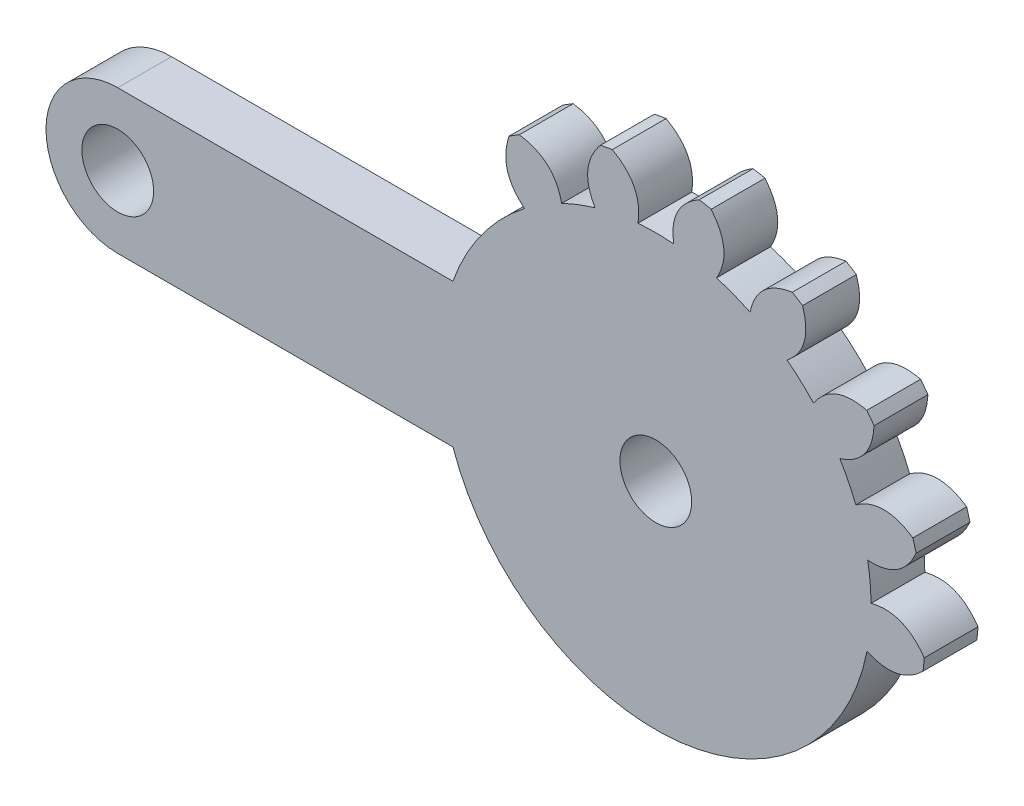
ISO-10303-21;
HEADER;
FILE_DESCRIPTION(('STEP AP214'),'2;1');
FILE_NAME('part.step','',(''),(''),'','','');
FILE_SCHEMA(('AUTOMOTIVE_DESIGN { 1 0 10303 214 1 1 1 1 }'));
ENDSEC;
DATA;
#1=APPLICATION_CONTEXT('core data for automotive mechanical design processes');
#2=APPLICATION_PROTOCOL_DEFINITION('international standard','automotive_design',2000,#1);
#3=PRODUCT_CONTEXT('',#1,'mechanical');
#4=PRODUCT('Part','Part','',(#3));
#5=PRODUCT_RELATED_PRODUCT_CATEGORY('part','',(#4));
#6=PRODUCT_DEFINITION_FORMATION('','',#4);
#7=PRODUCT_DEFINITION_CONTEXT('part definition',#1,'design');
#8=PRODUCT_DEFINITION('design','',#6,#7);
#9=PRODUCT_DEFINITION_SHAPE('','',#8);
#10=(LENGTH_UNIT() NAMED_UNIT(*) SI_UNIT(.MILLI.,.METRE.));
#11=(NAMED_UNIT(*) PLANE_ANGLE_UNIT() SI_UNIT($,.RADIAN.));
#12=(NAMED_UNIT(*) SI_UNIT($,.STERADIAN.) SOLID_ANGLE_UNIT());
#13=UNCERTAINTY_MEASURE_WITH_UNIT(LENGTH_MEASURE(1.E-05),#10,'distance_accuracy_value','');
#14=(GEOMETRIC_REPRESENTATION_CONTEXT(3) GLOBAL_UNCERTAINTY_ASSIGNED_CONTEXT((#13)) GLOBAL_UNIT_ASSIGNED_CONTEXT((#10,
#11,#12)) REPRESENTATION_CONTEXT('',''));
#15=CARTESIAN_POINT('',(0.,0.,0.));
#16=DIRECTION('',(0.,0.,1.));
#17=DIRECTION('',(1.,0.,0.));
#18=AXIS2_PLACEMENT_3D('',#15,#16,#17);
#19=CARTESIAN_POINT('',(0.,0.,3.));
#20=DIRECTION('',(0.,0.,-1.));
#21=DIRECTION('',(0.273662990072083,0.961825643172819,0.));
#22=AXIS2_PLACEMENT_3D('',#19,#20,#21);
#23=CYLINDRICAL_SURFACE('',#22,12.);
#24=DIRECTION('',(0.,0.,-1.));
#25=VECTOR('',#24,1.);
#26=CARTESIAN_POINT('',(-11.3137084989847,-4.0000000000001,3.));
#27=LINE('',#26,#25);
#28=CARTESIAN_POINT('',(-11.3137084989847,-4.0000000000001,0.));
#29=VERTEX_POINT('',#28);
#30=CARTESIAN_POINT('',(-11.3137084989847,-4.0000000000001,3.));
#31=VERTEX_POINT('',#30);
#32=EDGE_CURVE('E11',#29,#31,#27,.F.);
#33=ORIENTED_EDGE('',*,*,#32,.F.);
#34=CARTESIAN_POINT('',(0.,0.,0.));
#35=DIRECTION('',(0.,0.,-1.));
#36=DIRECTION('',(-0.273662990072083,-0.961825643172819,0.));
#37=AXIS2_PLACEMENT_3D('',#34,#35,#36);
#38=CIRCLE('',#37,12.);
#39=CARTESIAN_POINT('',(11.7754248205339,-2.31070774784592,0.));
#40=VERTEX_POINT('',#39);
#41=EDGE_CURVE('E462',#40,#29,#38,.T.);
#42=ORIENTED_EDGE('',*,*,#41,.F.);
#43=DIRECTION('',(0.,0.,-1.));
#44=VECTOR('',#43,1.);
#45=CARTESIAN_POINT('',(11.7754248205339,-2.31070774784592,3.));
#46=LINE('',#45,#44);
#47=CARTESIAN_POINT('',(11.7754248205339,-2.31070774784592,3.));
#48=VERTEX_POINT('',#47);
#49=EDGE_CURVE('E467',#48,#40,#46,.T.);
#50=ORIENTED_EDGE('',*,*,#49,.F.);
#51=CARTESIAN_POINT('',(0.,0.,3.));
#52=DIRECTION('',(0.,0.,-1.));
#53=DIRECTION('',(-0.273662990072083,-0.961825643172819,0.));
#54=AXIS2_PLACEMENT_3D('',#51,#52,#53);
#55=CIRCLE('',#54,12.);
#56=EDGE_CURVE('E471',#48,#31,#55,.T.);
#57=ORIENTED_EDGE('',*,*,#56,.T.);
#58=EDGE_LOOP('',(#33,#42,#50,#57));
#59=FACE_BOUND('',#58,.T.);
#60=ADVANCED_FACE('F36',(#59),#23,.T.);
#61=CARTESIAN_POINT('',(0.,0.,3.));
#62=DIRECTION('',(0.,0.,1.));
#63=DIRECTION('',(1.,0.,0.));
#64=AXIS2_PLACEMENT_3D('',#61,#62,#63);
#65=PLANE('',#64);
#66=CARTESIAN_POINT('',(0.,0.,3.));
#67=DIRECTION('',(0.,0.,-1.));
#68=DIRECTION('',(-1.,0.,0.));
#69=AXIS2_PLACEMENT_3D('',#66,#67,#68);
#70=CIRCLE('',#69,2.);
#71=CARTESIAN_POINT('',(-2.,0.,3.));
#72=VERTEX_POINT('',#71);
#73=EDGE_CURVE('E271',#72,#72,#70,.T.);
#74=ORIENTED_EDGE('',*,*,#73,.T.);
#75=EDGE_LOOP('',(#74));
#76=FACE_BOUND('',#75,.T.);
#77=CARTESIAN_POINT('',(-30.,-1.04950770296597E-13,3.));
#78=DIRECTION('',(0.,0.,-1.));
#79=DIRECTION('',(-1.,0.,0.));
#80=AXIS2_PLACEMENT_3D('',#77,#78,#79);
#81=CIRCLE('',#80,2.);
#82=CARTESIAN_POINT('',(-32.,-1.04950770296597E-13,3.));
#83=VERTEX_POINT('',#82);
#84=EDGE_CURVE('E732',#83,#83,#81,.T.);
#85=ORIENTED_EDGE('',*,*,#84,.T.);
#86=EDGE_LOOP('',(#85));
#87=FACE_BOUND('',#86,.T.);
#88=DIRECTION('',(1.,0.,0.));
#89=VECTOR('',#88,1.);
#90=CARTESIAN_POINT('',(-30.,-4.0000000000001,3.));
#91=LINE('',#90,#89);
#92=CARTESIAN_POINT('',(-30.,-4.0000000000001,3.));
#93=VERTEX_POINT('',#92);
#94=EDGE_CURVE('E253',#93,#31,#91,.T.);
#95=ORIENTED_EDGE('',*,*,#94,.T.);
#96=ORIENTED_EDGE('',*,*,#56,.F.);
#97=CARTESIAN_POINT('',(14.9009709527392,-1.72077443775263,3.));
#98=CARTESIAN_POINT('',(13.4869977113862,-3.11181198953527,3.));
#99=CARTESIAN_POINT('',(11.7754248205339,-2.31070774784592,3.));
#100=B_SPLINE_CURVE_WITH_KNOTS('',2,(#97,#98,#99),.UNSPECIFIED.,.F.,.F.,(3,3),(0.,1.),.UNSPECIFIED.);
#101=CARTESIAN_POINT('',(14.9009709527392,-1.72077443775263,3.));
#102=VERTEX_POINT('',#101);
#103=EDGE_CURVE('E453',#102,#48,#100,.T.);
#104=ORIENTED_EDGE('',*,*,#103,.F.);
#105=CARTESIAN_POINT('',(0.,0.,3.));
#106=DIRECTION('',(0.,0.,1.));
#107=DIRECTION('',(1.,0.,0.));
#108=AXIS2_PLACEMENT_3D('',#105,#106,#107);
#109=CIRCLE('',#108,15.);
#110=CARTESIAN_POINT('',(14.9634450789219,-1.04657124463003,3.));
#111=VERTEX_POINT('',#110);
#112=EDGE_CURVE('E601',#102,#111,#109,.T.);
#113=ORIENTED_EDGE('',*,*,#112,.T.);
#114=CARTESIAN_POINT('',(11.9995172704166,0.107634924505339,3.));
#115=CARTESIAN_POINT('',(13.8291498984039,0.580598150726615,3.));
#116=CARTESIAN_POINT('',(14.963445078922,-1.04657124463002,3.));
#117=B_SPLINE_CURVE_WITH_KNOTS('',2,(#114,#115,#116),.UNSPECIFIED.,.F.,.F.,(3,3),(0.,1.),.UNSPECIFIED.);
#118=CARTESIAN_POINT('',(11.9995172704166,0.107634924505339,3.));
#119=VERTEX_POINT('',#118);
#120=EDGE_CURVE('E414',#119,#111,#117,.T.);
#121=ORIENTED_EDGE('',*,*,#120,.F.);
#122=CARTESIAN_POINT('',(0.,0.,3.));
#123=DIRECTION('',(0.,0.,-1.));
#124=DIRECTION('',(0.092268359463302,-0.995734176295035,0.));
#125=AXIS2_PLACEMENT_3D('',#122,#123,#124);
#126=CIRCLE('',#125,12.);
#127=CARTESIAN_POINT('',(11.81498055149,2.09910327709541,3.));
#128=VERTEX_POINT('',#127);
#129=EDGE_CURVE('E641',#128,#119,#126,.T.);
#130=ORIENTED_EDGE('',*,*,#129,.F.);
#131=CARTESIAN_POINT('',(14.5163570296163,3.77827719850066,3.));
#132=CARTESIAN_POINT('',(13.7003669718686,1.9703872617543,3.));
#133=CARTESIAN_POINT('',(11.81498055149,2.09910327709541,3.));
#134=B_SPLINE_CURVE_WITH_KNOTS('',2,(#131,#132,#133),.UNSPECIFIED.,.F.,.F.,(3,3),(0.,1.),.UNSPECIFIED.);
#135=CARTESIAN_POINT('',(14.5163570296163,3.77827719850066,3.));
#136=VERTEX_POINT('',#135);
#137=EDGE_CURVE('E423',#136,#128,#134,.T.);
#138=ORIENTED_EDGE('',*,*,#137,.F.);
#139=CARTESIAN_POINT('',(14.3310621325057,4.42952121049907,3.));
#140=VERTEX_POINT('',#139);
#141=EDGE_CURVE('E612',#136,#140,#109,.T.);
#142=ORIENTED_EDGE('',*,*,#141,.T.);
#143=CARTESIAN_POINT('',(11.1503344014532,4.43509219022208,3.));
#144=CARTESIAN_POINT('',(12.685561993178,5.5370568032474,3.));
#145=CARTESIAN_POINT('',(14.3310621325057,4.42952121049907,3.));
#146=B_SPLINE_CURVE_WITH_KNOTS('',2,(#143,#144,#145),.UNSPECIFIED.,.F.,.F.,(3,3),(0.,1.),.UNSPECIFIED.);
#147=CARTESIAN_POINT('',(11.1503344014532,4.43509219022208,3.));
#148=VERTEX_POINT('',#147);
#149=EDGE_CURVE('E339',#148,#140,#146,.T.);
#150=ORIENTED_EDGE('',*,*,#149,.F.);
#151=CARTESIAN_POINT('',(0.,0.,3.));
#152=DIRECTION('',(0.,0.,-1.));
#153=DIRECTION('',(0.445738355776538,-0.895163291355062,0.));
#154=AXIS2_PLACEMENT_3D('',#151,#152,#153);
#155=CIRCLE('',#154,12.);
#156=CARTESIAN_POINT('',(10.2588576899001,6.2254187729322,3.));
#157=VERTEX_POINT('',#156);
#158=EDGE_CURVE('E1062',#157,#148,#155,.T.);
#159=ORIENTED_EDGE('',*,*,#158,.F.);
#160=CARTESIAN_POINT('',(12.1712286517326,8.76705156293972,3.));
#161=CARTESIAN_POINT('',(12.063425756446,6.78647479505122,3.));
#162=CARTESIAN_POINT('',(10.2588576899001,6.2254187729322,3.));
#163=B_SPLINE_CURVE_WITH_KNOTS('',2,(#160,#161,#162),.UNSPECIFIED.,.F.,.F.,(3,3),(0.,1.),.UNSPECIFIED.);
#164=CARTESIAN_POINT('',(12.1712286517326,8.76705156293973,3.));
#165=VERTEX_POINT('',#164);
#166=EDGE_CURVE('E346',#165,#157,#163,.T.);
#167=ORIENTED_EDGE('',*,*,#166,.F.);
#168=CARTESIAN_POINT('',(11.7631898339379,9.30738228132592,3.));
#169=VERTEX_POINT('',#168);
#170=EDGE_CURVE('E607',#165,#169,#109,.T.);
#171=ORIENTED_EDGE('',*,*,#170,.T.);
#172=CARTESIAN_POINT('',(8.79523708543771,8.16356567995512,3.));
#173=CARTESIAN_POINT('',(9.82871864764787,9.74570525259871,3.));
#174=CARTESIAN_POINT('',(11.7631898339379,9.30738228132592,3.));
#175=B_SPLINE_CURVE_WITH_KNOTS('',2,(#172,#173,#174),.UNSPECIFIED.,.F.,.F.,(3,3),(0.,1.),.UNSPECIFIED.);
#176=CARTESIAN_POINT('',(8.79523708543771,8.16356567995512,3.));
#177=VERTEX_POINT('',#176);
#178=EDGE_CURVE('E377',#177,#169,#175,.T.);
#179=ORIENTED_EDGE('',*,*,#178,.F.);
#180=CARTESIAN_POINT('',(0.,0.,3.));
#181=DIRECTION('',(0.,0.,-1.));
#182=DIRECTION('',(0.739008917220659,-0.673695643646557,0.));
#183=AXIS2_PLACEMENT_3D('',#180,#181,#182);
#184=CIRCLE('',#183,12.);
#185=CARTESIAN_POINT('',(7.3172192509964,9.51095696724824,3.));
#186=VERTEX_POINT('',#185);
#187=EDGE_CURVE('E677',#186,#177,#184,.T.);
#188=ORIENTED_EDGE('',*,*,#187,.F.);
#189=CARTESIAN_POINT('',(8.18230840132622,12.571787033894,3.));
#190=CARTESIAN_POINT('',(8.79725204686573,10.6860113021215,3.));
#191=CARTESIAN_POINT('',(7.31721925099639,9.51095696724824,3.));
#192=B_SPLINE_CURVE_WITH_KNOTS('',2,(#189,#190,#191),.UNSPECIFIED.,.F.,.F.,(3,3),(0.,1.),.UNSPECIFIED.);
#193=CARTESIAN_POINT('',(8.18230840132622,12.571787033894,3.));
#194=VERTEX_POINT('',#193);
#195=EDGE_CURVE('E386',#194,#186,#192,.T.);
#196=ORIENTED_EDGE('',*,*,#195,.F.);
#197=CARTESIAN_POINT('',(7.60663356621178,12.9282298010741,3.));
#198=VERTEX_POINT('',#197);
#199=EDGE_CURVE('E602',#194,#198,#109,.T.);
#200=ORIENTED_EDGE('',*,*,#199,.T.);
#201=CARTESIAN_POINT('',(5.25229426494273,10.7895043887312,3.));
#202=CARTESIAN_POINT('',(5.64445238594272,12.6381422047695,3.));
#203=CARTESIAN_POINT('',(7.60663356621178,12.9282298010741,3.));
#204=B_SPLINE_CURVE_WITH_KNOTS('',2,(#201,#202,#203),.UNSPECIFIED.,.F.,.F.,(3,3),(0.,1.),.UNSPECIFIED.);
#205=CARTESIAN_POINT('',(5.25229426494273,10.7895043887312,3.));
#206=VERTEX_POINT('',#205);
#207=EDGE_CURVE('E482',#206,#198,#204,.T.);
#208=ORIENTED_EDGE('',*,*,#207,.F.);
#209=CARTESIAN_POINT('',(0.,0.,3.));
#210=DIRECTION('',(0.,0.,-1.));
#211=DIRECTION('',(0.932472229404356,-0.361241666187153,0.));
#212=AXIS2_PLACEMENT_3D('',#209,#210,#211);
#213=CIRCLE('',#212,12.);
#214=CARTESIAN_POINT('',(3.38734980613402,11.5119877211055,3.));
#215=VERTEX_POINT('',#214);
#216=EDGE_CURVE('E703',#215,#206,#213,.T.);
#217=ORIENTED_EDGE('',*,*,#216,.F.);
#218=CARTESIAN_POINT('',(3.08832206158472,14.6786330032442,3.));
#219=CARTESIAN_POINT('',(4.34296070109982,13.1423427696075,3.));
#220=CARTESIAN_POINT('',(3.38734980613401,11.5119877211055,3.));
#221=B_SPLINE_CURVE_WITH_KNOTS('',2,(#218,#219,#220),.UNSPECIFIED.,.F.,.F.,(3,3),(0.,1.),.UNSPECIFIED.);
#222=CARTESIAN_POINT('',(3.08832206158472,14.6786330032442,3.));
#223=VERTEX_POINT('',#222);
#224=EDGE_CURVE('E489',#223,#215,#221,.T.);
#225=ORIENTED_EDGE('',*,*,#224,.F.);
#226=CARTESIAN_POINT('',(2.42275928555709,14.8030482483929,3.));
#227=VERTEX_POINT('',#226);
#228=EDGE_CURVE('E498',#223,#227,#109,.T.);
#229=ORIENTED_EDGE('',*,*,#228,.T.);
#230=CARTESIAN_POINT('',(1.,11.9582607431014,3.));
#231=CARTESIAN_POINT('',(0.697871552525628,13.8237280218227,3.));
#232=CARTESIAN_POINT('',(2.42275928555709,14.8030482483929,3.));
#233=B_SPLINE_CURVE_WITH_KNOTS('',2,(#230,#231,#232),.UNSPECIFIED.,.F.,.F.,(3,3),(0.,1.),.UNSPECIFIED.);
#234=CARTESIAN_POINT('',(1.,11.9582607431014,3.));
#235=VERTEX_POINT('',#234);
#236=EDGE_CURVE('E525',#235,#227,#233,.T.);
#237=ORIENTED_EDGE('',*,*,#236,.F.);
#238=CARTESIAN_POINT('',(0.,0.,3.));
#239=DIRECTION('',(0.,0.,-1.));
#240=DIRECTION('',(1.,0.,0.));
#241=AXIS2_PLACEMENT_3D('',#238,#239,#240);
#242=CIRCLE('',#241,12.);
#243=CARTESIAN_POINT('',(-0.999999999999999,11.9582607431014,3.));
#244=VERTEX_POINT('',#243);
#245=EDGE_CURVE('E533',#244,#235,#242,.T.);
#246=ORIENTED_EDGE('',*,*,#245,.F.);
#247=CARTESIAN_POINT('',(-2.42275928555709,14.8030482483929,3.));
#248=CARTESIAN_POINT('',(-0.697871552525628,13.8237280218227,3.));
#249=CARTESIAN_POINT('',(-1.,11.9582607431014,3.));
#250=B_SPLINE_CURVE_WITH_KNOTS('',2,(#247,#248,#249),.UNSPECIFIED.,.F.,.F.,(3,3),(0.,1.),.UNSPECIFIED.);
#251=CARTESIAN_POINT('',(-2.42275928555709,14.8030482483929,3.));
#252=VERTEX_POINT('',#251);
#253=EDGE_CURVE('E555',#252,#244,#250,.T.);
#254=ORIENTED_EDGE('',*,*,#253,.F.);
#255=CARTESIAN_POINT('',(-3.08832206158473,14.6786330032442,3.));
#256=VERTEX_POINT('',#255);
#257=EDGE_CURVE('E589',#252,#256,#109,.T.);
#258=ORIENTED_EDGE('',*,*,#257,.T.);
#259=CARTESIAN_POINT('',(-3.38734980613402,11.5119877211055,3.));
#260=CARTESIAN_POINT('',(-4.34296070109982,13.1423427696075,3.));
#261=CARTESIAN_POINT('',(-3.08832206158472,14.6786330032442,3.));
#262=B_SPLINE_CURVE_WITH_KNOTS('',2,(#259,#260,#261),.UNSPECIFIED.,.F.,.F.,(3,3),(0.,1.),.UNSPECIFIED.);
#263=CARTESIAN_POINT('',(-3.38734980613402,11.5119877211055,3.));
#264=VERTEX_POINT('',#263);
#265=EDGE_CURVE('E277',#264,#256,#262,.T.);
#266=ORIENTED_EDGE('',*,*,#265,.F.);
#267=CARTESIAN_POINT('',(0.,0.,3.));
#268=DIRECTION('',(0.,0.,-1.));
#269=DIRECTION('',(0.932472229404356,0.361241666187153,0.));
#270=AXIS2_PLACEMENT_3D('',#267,#268,#269);
#271=CIRCLE('',#270,12.);
#272=CARTESIAN_POINT('',(-5.25229426494273,10.7895043887312,3.));
#273=VERTEX_POINT('',#272);
#274=EDGE_CURVE('E1087',#273,#264,#271,.T.);
#275=ORIENTED_EDGE('',*,*,#274,.F.);
#276=CARTESIAN_POINT('',(-7.60663356621178,12.9282298010741,3.));
#277=CARTESIAN_POINT('',(-5.64445238594272,12.6381422047695,3.));
#278=CARTESIAN_POINT('',(-5.25229426494273,10.7895043887312,3.));
#279=B_SPLINE_CURVE_WITH_KNOTS('',2,(#276,#277,#278),.UNSPECIFIED.,.F.,.F.,(3,3),(0.,1.),.UNSPECIFIED.);
#280=CARTESIAN_POINT('',(-7.60663356621178,12.9282298010741,3.));
#281=VERTEX_POINT('',#280);
#282=EDGE_CURVE('E284',#281,#273,#279,.T.);
#283=ORIENTED_EDGE('',*,*,#282,.F.);
#284=CARTESIAN_POINT('',(-8.18230840132622,12.571787033894,3.));
#285=VERTEX_POINT('',#284);
#286=EDGE_CURVE('E597',#281,#285,#109,.T.);
#287=ORIENTED_EDGE('',*,*,#286,.T.);
#288=CARTESIAN_POINT('',(-7.31721925099639,9.51095696724824,3.));
#289=CARTESIAN_POINT('',(-8.79725204686573,10.6860113021215,3.));
#290=CARTESIAN_POINT('',(-8.18230840132622,12.571787033894,3.));
#291=B_SPLINE_CURVE_WITH_KNOTS('',2,(#288,#289,#290),.UNSPECIFIED.,.F.,.F.,(3,3),(0.,1.),.UNSPECIFIED.);
#292=CARTESIAN_POINT('',(-7.31721925099639,9.51095696724824,3.));
#293=VERTEX_POINT('',#292);
#294=EDGE_CURVE('E317',#293,#285,#291,.T.);
#295=ORIENTED_EDGE('',*,*,#294,.F.);
#296=CARTESIAN_POINT('',(-11.3137084989848,3.9999999999999,3.));
#297=VERTEX_POINT('',#296);
#298=EDGE_CURVE('E470',#297,#293,#55,.T.);
#299=ORIENTED_EDGE('',*,*,#298,.F.);
#300=DIRECTION('',(-1.,0.,0.));
#301=VECTOR('',#300,1.);
#302=CARTESIAN_POINT('',(-30.,3.9999999999999,3.));
#303=LINE('',#302,#301);
#304=CARTESIAN_POINT('',(-30.,3.9999999999999,3.));
#305=VERTEX_POINT('',#304);
#306=EDGE_CURVE('E269',#297,#305,#303,.T.);
#307=ORIENTED_EDGE('',*,*,#306,.T.);
#308=CARTESIAN_POINT('',(-30.,-1.04950770296597E-13,3.));
#309=DIRECTION('',(0.,0.,1.));
#310=DIRECTION('',(1.,0.,0.));
#311=AXIS2_PLACEMENT_3D('',#308,#309,#310);
#312=CIRCLE('',#311,4.);
#313=EDGE_CURVE('E260',#305,#93,#312,.T.);
#314=ORIENTED_EDGE('',*,*,#313,.T.);
#315=EDGE_LOOP('',(#95,#96,#104,#113,#121,#130,#138,#142,#150,#159,#167,#171,#179,#188,#196,
#200,#208,#217,#225,#229,#237,#246,#254,#258,#266,#275,#283,#287,#295,#299,#307,#314));
#316=FACE_BOUND('',#315,.T.);
#317=ADVANCED_FACE('F624',(#76,#87,#316),#65,.T.);
#318=CARTESIAN_POINT('',(0.,0.,0.));
#319=DIRECTION('',(0.,0.,1.));
#320=DIRECTION('',(1.,0.,0.));
#321=AXIS2_PLACEMENT_3D('',#318,#319,#320);
#322=PLANE('',#321);
#323=CARTESIAN_POINT('',(0.,0.,0.));
#324=DIRECTION('',(0.,0.,-1.));
#325=DIRECTION('',(-1.,0.,0.));
#326=AXIS2_PLACEMENT_3D('',#323,#324,#325);
#327=CIRCLE('',#326,2.);
#328=CARTESIAN_POINT('',(-2.,0.,0.));
#329=VERTEX_POINT('',#328);
#330=EDGE_CURVE('E734',#329,#329,#327,.T.);
#331=ORIENTED_EDGE('',*,*,#330,.F.);
#332=EDGE_LOOP('',(#331));
#333=FACE_BOUND('',#332,.T.);
#334=CARTESIAN_POINT('',(-30.,-1.04950770296597E-13,0.));
#335=DIRECTION('',(0.,0.,-1.));
#336=DIRECTION('',(-1.,0.,0.));
#337=AXIS2_PLACEMENT_3D('',#334,#335,#336);
#338=CIRCLE('',#337,2.);
#339=CARTESIAN_POINT('',(-32.,-1.04950770296597E-13,0.));
#340=VERTEX_POINT('',#339);
#341=EDGE_CURVE('E735',#340,#340,#338,.T.);
#342=ORIENTED_EDGE('',*,*,#341,.F.);
#343=EDGE_LOOP('',(#342));
#344=FACE_BOUND('',#343,.T.);
#345=ORIENTED_EDGE('',*,*,#41,.T.);
#346=DIRECTION('',(1.,0.,0.));
#347=VECTOR('',#346,1.);
#348=CARTESIAN_POINT('',(-30.,-4.0000000000001,0.));
#349=LINE('',#348,#347);
#350=CARTESIAN_POINT('',(-30.,-4.0000000000001,0.));
#351=VERTEX_POINT('',#350);
#352=EDGE_CURVE('E262',#351,#29,#349,.T.);
#353=ORIENTED_EDGE('',*,*,#352,.F.);
#354=CARTESIAN_POINT('',(-30.,-1.04950770296597E-13,0.));
#355=DIRECTION('',(0.,0.,1.));
#356=DIRECTION('',(1.,0.,0.));
#357=AXIS2_PLACEMENT_3D('',#354,#355,#356);
#358=CIRCLE('',#357,4.);
#359=CARTESIAN_POINT('',(-30.,3.9999999999999,0.));
#360=VERTEX_POINT('',#359);
#361=EDGE_CURVE('E252',#360,#351,#358,.T.);
#362=ORIENTED_EDGE('',*,*,#361,.F.);
#363=DIRECTION('',(-1.,0.,0.));
#364=VECTOR('',#363,1.);
#365=CARTESIAN_POINT('',(-30.,3.9999999999999,0.));
#366=LINE('',#365,#364);
#367=CARTESIAN_POINT('',(-11.3137084989848,3.9999999999999,0.));
#368=VERTEX_POINT('',#367);
#369=EDGE_CURVE('E244',#368,#360,#366,.T.);
#370=ORIENTED_EDGE('',*,*,#369,.F.);
#371=CARTESIAN_POINT('',(-7.31721925099639,9.51095696724824,0.));
#372=VERTEX_POINT('',#371);
#373=EDGE_CURVE('E51',#368,#372,#38,.T.);
#374=ORIENTED_EDGE('',*,*,#373,.T.);
#375=CARTESIAN_POINT('',(-7.31721925099639,9.51095696724824,0.));
#376=CARTESIAN_POINT('',(-8.79725204686573,10.6860113021215,0.));
#377=CARTESIAN_POINT('',(-8.18230840132622,12.571787033894,0.));
#378=B_SPLINE_CURVE_WITH_KNOTS('',2,(#375,#376,#377),.UNSPECIFIED.,.F.,.F.,(3,3),(0.,1.),.UNSPECIFIED.);
#379=CARTESIAN_POINT('',(-8.18230840132622,12.571787033894,0.));
#380=VERTEX_POINT('',#379);
#381=EDGE_CURVE('E327',#372,#380,#378,.T.);
#382=ORIENTED_EDGE('',*,*,#381,.T.);
#383=CARTESIAN_POINT('',(0.,0.,0.));
#384=DIRECTION('',(0.,0.,1.));
#385=DIRECTION('',(1.,0.,0.));
#386=AXIS2_PLACEMENT_3D('',#383,#384,#385);
#387=CIRCLE('',#386,15.);
#388=CARTESIAN_POINT('',(-7.60663356621178,12.9282298010741,0.));
#389=VERTEX_POINT('',#388);
#390=EDGE_CURVE('E581',#389,#380,#387,.T.);
#391=ORIENTED_EDGE('',*,*,#390,.F.);
#392=CARTESIAN_POINT('',(-7.60663356621178,12.9282298010741,0.));
#393=CARTESIAN_POINT('',(-5.64445238594272,12.6381422047695,0.));
#394=CARTESIAN_POINT('',(-5.25229426494273,10.7895043887312,0.));
#395=B_SPLINE_CURVE_WITH_KNOTS('',2,(#392,#393,#394),.UNSPECIFIED.,.F.,.F.,(3,3),(0.,1.),.UNSPECIFIED.);
#396=CARTESIAN_POINT('',(-5.25229426494273,10.7895043887312,0.));
#397=VERTEX_POINT('',#396);
#398=EDGE_CURVE('E1086',#389,#397,#395,.T.);
#399=ORIENTED_EDGE('',*,*,#398,.T.);
#400=CARTESIAN_POINT('',(0.,0.,0.));
#401=DIRECTION('',(0.,0.,-1.));
#402=DIRECTION('',(0.932472229404356,0.361241666187153,0.));
#403=AXIS2_PLACEMENT_3D('',#400,#401,#402);
#404=CIRCLE('',#403,12.);
#405=CARTESIAN_POINT('',(-3.38734980613402,11.5119877211055,0.));
#406=VERTEX_POINT('',#405);
#407=EDGE_CURVE('E1099',#397,#406,#404,.T.);
#408=ORIENTED_EDGE('',*,*,#407,.T.);
#409=CARTESIAN_POINT('',(-3.38734980613402,11.5119877211055,0.));
#410=CARTESIAN_POINT('',(-4.34296070109982,13.1423427696075,0.));
#411=CARTESIAN_POINT('',(-3.08832206158472,14.6786330032442,0.));
#412=B_SPLINE_CURVE_WITH_KNOTS('',2,(#409,#410,#411),.UNSPECIFIED.,.F.,.F.,(3,3),(0.,1.),.UNSPECIFIED.);
#413=CARTESIAN_POINT('',(-3.08832206158473,14.6786330032442,0.));
#414=VERTEX_POINT('',#413);
#415=EDGE_CURVE('E275',#406,#414,#412,.T.);
#416=ORIENTED_EDGE('',*,*,#415,.T.);
#417=CARTESIAN_POINT('',(-2.42275928555709,14.8030482483929,0.));
#418=VERTEX_POINT('',#417);
#419=EDGE_CURVE('E544',#418,#414,#387,.T.);
#420=ORIENTED_EDGE('',*,*,#419,.F.);
#421=CARTESIAN_POINT('',(-2.42275928555709,14.8030482483929,0.));
#422=CARTESIAN_POINT('',(-0.697871552525628,13.8237280218227,0.));
#423=CARTESIAN_POINT('',(-1.,11.9582607431014,0.));
#424=B_SPLINE_CURVE_WITH_KNOTS('',2,(#421,#422,#423),.UNSPECIFIED.,.F.,.F.,(3,3),(0.,1.),.UNSPECIFIED.);
#425=CARTESIAN_POINT('',(-0.999999999999999,11.9582607431014,0.));
#426=VERTEX_POINT('',#425);
#427=EDGE_CURVE('E535',#418,#426,#424,.T.);
#428=ORIENTED_EDGE('',*,*,#427,.T.);
#429=CARTESIAN_POINT('',(0.,0.,0.));
#430=DIRECTION('',(0.,0.,-1.));
#431=DIRECTION('',(1.,0.,0.));
#432=AXIS2_PLACEMENT_3D('',#429,#430,#431);
#433=CIRCLE('',#432,12.);
#434=CARTESIAN_POINT('',(1.,11.9582607431014,0.));
#435=VERTEX_POINT('',#434);
#436=EDGE_CURVE('E543',#426,#435,#433,.T.);
#437=ORIENTED_EDGE('',*,*,#436,.T.);
#438=CARTESIAN_POINT('',(1.,11.9582607431014,0.));
#439=CARTESIAN_POINT('',(0.697871552525628,13.8237280218227,0.));
#440=CARTESIAN_POINT('',(2.42275928555709,14.8030482483929,0.));
#441=B_SPLINE_CURVE_WITH_KNOTS('',2,(#438,#439,#440),.UNSPECIFIED.,.F.,.F.,(3,3),(0.,1.),.UNSPECIFIED.);
#442=CARTESIAN_POINT('',(2.42275928555709,14.8030482483929,0.));
#443=VERTEX_POINT('',#442);
#444=EDGE_CURVE('E550',#435,#443,#441,.T.);
#445=ORIENTED_EDGE('',*,*,#444,.T.);
#446=CARTESIAN_POINT('',(3.08832206158472,14.6786330032442,0.));
#447=VERTEX_POINT('',#446);
#448=EDGE_CURVE('E583',#447,#443,#387,.T.);
#449=ORIENTED_EDGE('',*,*,#448,.F.);
#450=CARTESIAN_POINT('',(3.08832206158472,14.6786330032442,0.));
#451=CARTESIAN_POINT('',(4.34296070109982,13.1423427696075,0.));
#452=CARTESIAN_POINT('',(3.38734980613401,11.5119877211055,0.));
#453=B_SPLINE_CURVE_WITH_KNOTS('',2,(#450,#451,#452),.UNSPECIFIED.,.F.,.F.,(3,3),(0.,1.),.UNSPECIFIED.);
#454=CARTESIAN_POINT('',(3.38734980613402,11.5119877211055,0.));
#455=VERTEX_POINT('',#454);
#456=EDGE_CURVE('E705',#447,#455,#453,.T.);
#457=ORIENTED_EDGE('',*,*,#456,.T.);
#458=CARTESIAN_POINT('',(0.,0.,0.));
#459=DIRECTION('',(0.,0.,-1.));
#460=DIRECTION('',(0.932472229404356,-0.361241666187153,0.));
#461=AXIS2_PLACEMENT_3D('',#458,#459,#460);
#462=CIRCLE('',#461,12.);
#463=CARTESIAN_POINT('',(5.25229426494273,10.7895043887312,0.));
#464=VERTEX_POINT('',#463);
#465=EDGE_CURVE('E692',#455,#464,#462,.T.);
#466=ORIENTED_EDGE('',*,*,#465,.T.);
#467=CARTESIAN_POINT('',(5.25229426494273,10.7895043887312,0.));
#468=CARTESIAN_POINT('',(5.64445238594272,12.6381422047695,0.));
#469=CARTESIAN_POINT('',(7.60663356621178,12.9282298010741,0.));
#470=B_SPLINE_CURVE_WITH_KNOTS('',2,(#467,#468,#469),.UNSPECIFIED.,.F.,.F.,(3,3),(0.,1.),.UNSPECIFIED.);
#471=CARTESIAN_POINT('',(7.60663356621178,12.9282298010741,0.));
#472=VERTEX_POINT('',#471);
#473=EDGE_CURVE('E395',#464,#472,#470,.T.);
#474=ORIENTED_EDGE('',*,*,#473,.T.);
#475=CARTESIAN_POINT('',(8.18230840132622,12.571787033894,0.));
#476=VERTEX_POINT('',#475);
#477=EDGE_CURVE('E588',#476,#472,#387,.T.);
#478=ORIENTED_EDGE('',*,*,#477,.F.);
#479=CARTESIAN_POINT('',(8.18230840132622,12.571787033894,0.));
#480=CARTESIAN_POINT('',(8.79725204686573,10.6860113021215,0.));
#481=CARTESIAN_POINT('',(7.31721925099639,9.51095696724824,0.));
#482=B_SPLINE_CURVE_WITH_KNOTS('',2,(#479,#480,#481),.UNSPECIFIED.,.F.,.F.,(3,3),(0.,1.),.UNSPECIFIED.);
#483=CARTESIAN_POINT('',(7.3172192509964,9.51095696724824,0.));
#484=VERTEX_POINT('',#483);
#485=EDGE_CURVE('E678',#476,#484,#482,.T.);
#486=ORIENTED_EDGE('',*,*,#485,.T.);
#487=CARTESIAN_POINT('',(0.,0.,0.));
#488=DIRECTION('',(0.,0.,-1.));
#489=DIRECTION('',(0.739008917220659,-0.673695643646557,0.));
#490=AXIS2_PLACEMENT_3D('',#487,#488,#489);
#491=CIRCLE('',#490,12.);
#492=CARTESIAN_POINT('',(8.79523708543771,8.16356567995512,0.));
#493=VERTEX_POINT('',#492);
#494=EDGE_CURVE('E667',#484,#493,#491,.T.);
#495=ORIENTED_EDGE('',*,*,#494,.T.);
#496=CARTESIAN_POINT('',(8.79523708543771,8.16356567995512,0.));
#497=CARTESIAN_POINT('',(9.82871864764787,9.74570525259871,0.));
#498=CARTESIAN_POINT('',(11.7631898339379,9.30738228132592,0.));
#499=B_SPLINE_CURVE_WITH_KNOTS('',2,(#496,#497,#498),.UNSPECIFIED.,.F.,.F.,(3,3),(0.,1.),.UNSPECIFIED.);
#500=CARTESIAN_POINT('',(11.7631898339379,9.30738228132592,0.));
#501=VERTEX_POINT('',#500);
#502=EDGE_CURVE('E355',#493,#501,#499,.T.);
#503=ORIENTED_EDGE('',*,*,#502,.T.);
#504=CARTESIAN_POINT('',(12.1712286517326,8.76705156293973,0.));
#505=VERTEX_POINT('',#504);
#506=EDGE_CURVE('E595',#505,#501,#387,.T.);
#507=ORIENTED_EDGE('',*,*,#506,.F.);
#508=CARTESIAN_POINT('',(12.1712286517326,8.76705156293972,0.));
#509=CARTESIAN_POINT('',(12.063425756446,6.78647479505122,0.));
#510=CARTESIAN_POINT('',(10.2588576899001,6.2254187729322,0.));
#511=B_SPLINE_CURVE_WITH_KNOTS('',2,(#508,#509,#510),.UNSPECIFIED.,.F.,.F.,(3,3),(0.,1.),.UNSPECIFIED.);
#512=CARTESIAN_POINT('',(10.2588576899001,6.2254187729322,0.));
#513=VERTEX_POINT('',#512);
#514=EDGE_CURVE('E664',#505,#513,#511,.T.);
#515=ORIENTED_EDGE('',*,*,#514,.T.);
#516=CARTESIAN_POINT('',(0.,0.,0.));
#517=DIRECTION('',(0.,0.,-1.));
#518=DIRECTION('',(0.445738355776538,-0.895163291355062,0.));
#519=AXIS2_PLACEMENT_3D('',#516,#517,#518);
#520=CIRCLE('',#519,12.);
#521=CARTESIAN_POINT('',(11.1503344014532,4.43509219022208,0.));
#522=VERTEX_POINT('',#521);
#523=EDGE_CURVE('E1059',#513,#522,#520,.T.);
#524=ORIENTED_EDGE('',*,*,#523,.T.);
#525=CARTESIAN_POINT('',(11.1503344014532,4.43509219022208,0.));
#526=CARTESIAN_POINT('',(12.685561993178,5.5370568032474,0.));
#527=CARTESIAN_POINT('',(14.3310621325057,4.42952121049907,0.));
#528=B_SPLINE_CURVE_WITH_KNOTS('',2,(#525,#526,#527),.UNSPECIFIED.,.F.,.F.,(3,3),(0.,1.),.UNSPECIFIED.);
#529=CARTESIAN_POINT('',(14.3310621325057,4.42952121049907,0.));
#530=VERTEX_POINT('',#529);
#531=EDGE_CURVE('E357',#522,#530,#528,.T.);
#532=ORIENTED_EDGE('',*,*,#531,.T.);
#533=CARTESIAN_POINT('',(14.5163570296163,3.77827719850066,0.));
#534=VERTEX_POINT('',#533);
#535=EDGE_CURVE('E655',#534,#530,#387,.T.);
#536=ORIENTED_EDGE('',*,*,#535,.F.);
#537=CARTESIAN_POINT('',(14.5163570296163,3.77827719850066,0.));
#538=CARTESIAN_POINT('',(13.7003669718686,1.9703872617543,0.));
#539=CARTESIAN_POINT('',(11.81498055149,2.09910327709541,0.));
#540=B_SPLINE_CURVE_WITH_KNOTS('',2,(#537,#538,#539),.UNSPECIFIED.,.F.,.F.,(3,3),(0.,1.),.UNSPECIFIED.);
#541=CARTESIAN_POINT('',(11.81498055149,2.09910327709541,0.));
#542=VERTEX_POINT('',#541);
#543=EDGE_CURVE('E643',#534,#542,#540,.T.);
#544=ORIENTED_EDGE('',*,*,#543,.T.);
#545=CARTESIAN_POINT('',(0.,0.,0.));
#546=DIRECTION('',(0.,0.,-1.));
#547=DIRECTION('',(0.092268359463302,-0.995734176295035,0.));
#548=AXIS2_PLACEMENT_3D('',#545,#546,#547);
#549=CIRCLE('',#548,12.);
#550=CARTESIAN_POINT('',(11.9995172704166,0.107634924505339,0.));
#551=VERTEX_POINT('',#550);
#552=EDGE_CURVE('E633',#542,#551,#549,.T.);
#553=ORIENTED_EDGE('',*,*,#552,.T.);
#554=CARTESIAN_POINT('',(11.9995172704166,0.107634924505339,0.));
#555=CARTESIAN_POINT('',(13.8291498984039,0.580598150726615,0.));
#556=CARTESIAN_POINT('',(14.963445078922,-1.04657124463002,0.));
#557=B_SPLINE_CURVE_WITH_KNOTS('',2,(#554,#555,#556),.UNSPECIFIED.,.F.,.F.,(3,3),(0.,1.),.UNSPECIFIED.);
#558=CARTESIAN_POINT('',(14.963445078922,-1.04657124463002,0.));
#559=VERTEX_POINT('',#558);
#560=EDGE_CURVE('E433',#551,#559,#557,.T.);
#561=ORIENTED_EDGE('',*,*,#560,.T.);
#562=CARTESIAN_POINT('',(14.9009709527392,-1.72077443775263,0.));
#563=VERTEX_POINT('',#562);
#564=EDGE_CURVE('E585',#563,#559,#387,.T.);
#565=ORIENTED_EDGE('',*,*,#564,.F.);
#566=CARTESIAN_POINT('',(14.9009709527392,-1.72077443775263,0.));
#567=CARTESIAN_POINT('',(13.4869977113862,-3.11181198953527,0.));
#568=CARTESIAN_POINT('',(11.7754248205339,-2.31070774784592,0.));
#569=B_SPLINE_CURVE_WITH_KNOTS('',2,(#566,#567,#568),.UNSPECIFIED.,.F.,.F.,(3,3),(0.,1.),.UNSPECIFIED.);
#570=EDGE_CURVE('E473',#563,#40,#569,.T.);
#571=ORIENTED_EDGE('',*,*,#570,.T.);
#572=EDGE_LOOP('',(#345,#353,#362,#370,#374,#382,#391,#399,#408,#416,#420,#428,#437,#445,#449,
#457,#466,#474,#478,#486,#495,#503,#507,#515,#524,#532,#536,#544,#553,#561,#565,#571));
#573=FACE_BOUND('',#572,.T.);
#574=ADVANCED_FACE('F38',(#333,#344,#573),#322,.F.);
#575=CARTESIAN_POINT('',(0.,0.,0.));
#576=DIRECTION('',(0.,0.,1.));
#577=DIRECTION('',(1.,0.,0.));
#578=AXIS2_PLACEMENT_3D('',#575,#576,#577);
#579=CYLINDRICAL_SURFACE('',#578,15.);
#580=ORIENTED_EDGE('',*,*,#170,.F.);
#581=DIRECTION('',(0.,0.,-1.));
#582=VECTOR('',#581,1.);
#583=CARTESIAN_POINT('',(12.1712286517326,8.76705156293973,3.));
#584=LINE('',#583,#582);
#585=EDGE_CURVE('E356',#165,#505,#584,.T.);
#586=ORIENTED_EDGE('',*,*,#585,.T.);
#587=ORIENTED_EDGE('',*,*,#506,.T.);
#588=DIRECTION('',(0.,0.,-1.));
#589=VECTOR('',#588,1.);
#590=CARTESIAN_POINT('',(11.7631898339379,9.30738228132592,3.));
#591=LINE('',#590,#589);
#592=EDGE_CURVE('E383',#169,#501,#591,.T.);
#593=ORIENTED_EDGE('',*,*,#592,.F.);
#594=EDGE_LOOP('',(#580,#586,#587,#593));
#595=FACE_BOUND('',#594,.T.);
#596=ADVANCED_FACE('F513',(#595),#579,.T.);
#597=ORIENTED_EDGE('',*,*,#535,.T.);
#598=DIRECTION('',(0.,0.,-1.));
#599=VECTOR('',#598,1.);
#600=CARTESIAN_POINT('',(14.3310621325057,4.42952121049907,3.));
#601=LINE('',#600,#599);
#602=EDGE_CURVE('E344',#140,#530,#601,.T.);
#603=ORIENTED_EDGE('',*,*,#602,.F.);
#604=ORIENTED_EDGE('',*,*,#141,.F.);
#605=DIRECTION('',(0.,0.,-1.));
#606=VECTOR('',#605,1.);
#607=CARTESIAN_POINT('',(14.5163570296163,3.77827719850066,3.));
#608=LINE('',#607,#606);
#609=EDGE_CURVE('E432',#136,#534,#608,.T.);
#610=ORIENTED_EDGE('',*,*,#609,.T.);
#611=EDGE_LOOP('',(#597,#603,#604,#610));
#612=FACE_BOUND('',#611,.T.);
#613=ADVANCED_FACE('F516',(#612),#579,.T.);
#614=ORIENTED_EDGE('',*,*,#199,.F.);
#615=DIRECTION('',(0.,0.,-1.));
#616=VECTOR('',#615,1.);
#617=CARTESIAN_POINT('',(8.18230840132622,12.571787033894,3.));
#618=LINE('',#617,#616);
#619=EDGE_CURVE('E396',#194,#476,#618,.T.);
#620=ORIENTED_EDGE('',*,*,#619,.T.);
#621=ORIENTED_EDGE('',*,*,#477,.T.);
#622=DIRECTION('',(0.,0.,-1.));
#623=VECTOR('',#622,1.);
#624=CARTESIAN_POINT('',(7.60663356621178,12.9282298010741,3.));
#625=LINE('',#624,#623);
#626=EDGE_CURVE('E487',#198,#472,#625,.T.);
#627=ORIENTED_EDGE('',*,*,#626,.F.);
#628=EDGE_LOOP('',(#614,#620,#621,#627));
#629=FACE_BOUND('',#628,.T.);
#630=ADVANCED_FACE('F687',(#629),#579,.T.);
#631=ORIENTED_EDGE('',*,*,#564,.T.);
#632=DIRECTION('',(0.,0.,-1.));
#633=VECTOR('',#632,1.);
#634=CARTESIAN_POINT('',(14.963445078922,-1.04657124463002,3.));
#635=LINE('',#634,#633);
#636=EDGE_CURVE('E420',#111,#559,#635,.T.);
#637=ORIENTED_EDGE('',*,*,#636,.F.);
#638=ORIENTED_EDGE('',*,*,#112,.F.);
#639=DIRECTION('',(0.,0.,-1.));
#640=VECTOR('',#639,1.);
#641=CARTESIAN_POINT('',(14.9009709527392,-1.72077443775263,3.));
#642=LINE('',#641,#640);
#643=EDGE_CURVE('E460',#102,#563,#642,.T.);
#644=ORIENTED_EDGE('',*,*,#643,.T.);
#645=EDGE_LOOP('',(#631,#637,#638,#644));
#646=FACE_BOUND('',#645,.T.);
#647=ADVANCED_FACE('F630',(#646),#579,.T.);
#648=ORIENTED_EDGE('',*,*,#286,.F.);
#649=DIRECTION('',(0.,0.,-1.));
#650=VECTOR('',#649,1.);
#651=CARTESIAN_POINT('',(-7.60663356621178,12.9282298010741,3.));
#652=LINE('',#651,#650);
#653=EDGE_CURVE('E325',#281,#389,#652,.T.);
#654=ORIENTED_EDGE('',*,*,#653,.T.);
#655=ORIENTED_EDGE('',*,*,#390,.T.);
#656=DIRECTION('',(0.,0.,-1.));
#657=VECTOR('',#656,1.);
#658=CARTESIAN_POINT('',(-8.18230840132622,12.571787033894,3.));
#659=LINE('',#658,#657);
#660=EDGE_CURVE('E323',#285,#380,#659,.T.);
#661=ORIENTED_EDGE('',*,*,#660,.F.);
#662=EDGE_LOOP('',(#648,#654,#655,#661));
#663=FACE_BOUND('',#662,.T.);
#664=ADVANCED_FACE('F815',(#663),#579,.T.);
#665=ORIENTED_EDGE('',*,*,#419,.T.);
#666=DIRECTION('',(0.,0.,-1.));
#667=VECTOR('',#666,1.);
#668=CARTESIAN_POINT('',(-3.08832206158473,14.6786330032442,3.));
#669=LINE('',#668,#667);
#670=EDGE_CURVE('E282',#256,#414,#669,.T.);
#671=ORIENTED_EDGE('',*,*,#670,.F.);
#672=ORIENTED_EDGE('',*,*,#257,.F.);
#673=DIRECTION('',(0.,0.,-1.));
#674=VECTOR('',#673,1.);
#675=CARTESIAN_POINT('',(-2.42275928555709,14.8030482483929,3.));
#676=LINE('',#675,#674);
#677=EDGE_CURVE('E532',#252,#418,#676,.T.);
#678=ORIENTED_EDGE('',*,*,#677,.T.);
#679=EDGE_LOOP('',(#665,#671,#672,#678));
#680=FACE_BOUND('',#679,.T.);
#681=ADVANCED_FACE('F821',(#680),#579,.T.);
#682=ORIENTED_EDGE('',*,*,#228,.F.);
#683=DIRECTION('',(0.,0.,-1.));
#684=VECTOR('',#683,1.);
#685=CARTESIAN_POINT('',(3.08832206158472,14.6786330032442,3.));
#686=LINE('',#685,#684);
#687=EDGE_CURVE('E499',#223,#447,#686,.T.);
#688=ORIENTED_EDGE('',*,*,#687,.T.);
#689=ORIENTED_EDGE('',*,*,#448,.T.);
#690=DIRECTION('',(0.,0.,-1.));
#691=VECTOR('',#690,1.);
#692=CARTESIAN_POINT('',(2.42275928555709,14.8030482483929,3.));
#693=LINE('',#692,#691);
#694=EDGE_CURVE('E560',#227,#443,#693,.T.);
#695=ORIENTED_EDGE('',*,*,#694,.F.);
#696=EDGE_LOOP('',(#682,#688,#689,#695));
#697=FACE_BOUND('',#696,.T.);
#698=ADVANCED_FACE('F518',(#697),#579,.T.);
#699=DIRECTION('',(0.,0.,-1.));
#700=VECTOR('',#699,1.);
#701=SURFACE_OF_LINEAR_EXTRUSION('',#250,#700);
#702=ORIENTED_EDGE('',*,*,#427,.F.);
#703=ORIENTED_EDGE('',*,*,#677,.F.);
#704=ORIENTED_EDGE('',*,*,#253,.T.);
#705=DIRECTION('',(0.,0.,-1.));
#706=VECTOR('',#705,1.);
#707=CARTESIAN_POINT('',(-0.999999999999999,11.9582607431014,3.));
#708=LINE('',#707,#706);
#709=EDGE_CURVE('E565',#244,#426,#708,.T.);
#710=ORIENTED_EDGE('',*,*,#709,.T.);
#711=EDGE_LOOP('',(#702,#703,#704,#710));
#712=FACE_BOUND('',#711,.T.);
#713=ADVANCED_FACE('F570',(#712),#701,.T.);
#714=CARTESIAN_POINT('',(0.,0.,3.));
#715=DIRECTION('',(0.,0.,-1.));
#716=DIRECTION('',(-1.,0.,0.));
#717=AXIS2_PLACEMENT_3D('',#714,#715,#716);
#718=CYLINDRICAL_SURFACE('',#717,12.);
#719=ORIENTED_EDGE('',*,*,#436,.F.);
#720=ORIENTED_EDGE('',*,*,#709,.F.);
#721=ORIENTED_EDGE('',*,*,#245,.T.);
#722=DIRECTION('',(0.,0.,-1.));
#723=VECTOR('',#722,1.);
#724=CARTESIAN_POINT('',(1.,11.9582607431014,3.));
#725=LINE('',#724,#723);
#726=EDGE_CURVE('E563',#235,#435,#725,.T.);
#727=ORIENTED_EDGE('',*,*,#726,.T.);
#728=EDGE_LOOP('',(#719,#720,#721,#727));
#729=FACE_BOUND('',#728,.T.);
#730=ADVANCED_FACE('F522',(#729),#718,.T.);
#731=DIRECTION('',(0.,0.,-1.));
#732=VECTOR('',#731,1.);
#733=SURFACE_OF_LINEAR_EXTRUSION('',#233,#732);
#734=ORIENTED_EDGE('',*,*,#444,.F.);
#735=ORIENTED_EDGE('',*,*,#726,.F.);
#736=ORIENTED_EDGE('',*,*,#236,.T.);
#737=ORIENTED_EDGE('',*,*,#694,.T.);
#738=EDGE_LOOP('',(#734,#735,#736,#737));
#739=FACE_BOUND('',#738,.T.);
#740=ADVANCED_FACE('F511',(#739),#733,.T.);
#741=DIRECTION('',(0.,0.,-1.));
#742=VECTOR('',#741,1.);
#743=SURFACE_OF_LINEAR_EXTRUSION('',#221,#742);
#744=ORIENTED_EDGE('',*,*,#456,.F.);
#745=ORIENTED_EDGE('',*,*,#687,.F.);
#746=ORIENTED_EDGE('',*,*,#224,.T.);
#747=DIRECTION('',(0.,0.,-1.));
#748=VECTOR('',#747,1.);
#749=CARTESIAN_POINT('',(3.38734980613402,11.5119877211055,3.));
#750=LINE('',#749,#748);
#751=EDGE_CURVE('E700',#215,#455,#750,.T.);
#752=ORIENTED_EDGE('',*,*,#751,.T.);
#753=EDGE_LOOP('',(#744,#745,#746,#752));
#754=FACE_BOUND('',#753,.T.);
#755=ADVANCED_FACE('F507',(#754),#743,.T.);
#756=CARTESIAN_POINT('',(0.,0.,3.));
#757=DIRECTION('',(0.,0.,-1.));
#758=DIRECTION('',(-0.932472229404356,0.361241666187153,0.));
#759=AXIS2_PLACEMENT_3D('',#756,#757,#758);
#760=CYLINDRICAL_SURFACE('',#759,12.);
#761=ORIENTED_EDGE('',*,*,#465,.F.);
#762=ORIENTED_EDGE('',*,*,#751,.F.);
#763=ORIENTED_EDGE('',*,*,#216,.T.);
#764=DIRECTION('',(0.,0.,-1.));
#765=VECTOR('',#764,1.);
#766=CARTESIAN_POINT('',(5.25229426494273,10.7895043887312,3.));
#767=LINE('',#766,#765);
#768=EDGE_CURVE('E488',#206,#464,#767,.T.);
#769=ORIENTED_EDGE('',*,*,#768,.T.);
#770=EDGE_LOOP('',(#761,#762,#763,#769));
#771=FACE_BOUND('',#770,.T.);
#772=ADVANCED_FACE('F510',(#771),#760,.T.);
#773=DIRECTION('',(0.,0.,-1.));
#774=VECTOR('',#773,1.);
#775=SURFACE_OF_LINEAR_EXTRUSION('',#204,#774);
#776=ORIENTED_EDGE('',*,*,#473,.F.);
#777=ORIENTED_EDGE('',*,*,#768,.F.);
#778=ORIENTED_EDGE('',*,*,#207,.T.);
#779=ORIENTED_EDGE('',*,*,#626,.T.);
#780=EDGE_LOOP('',(#776,#777,#778,#779));
#781=FACE_BOUND('',#780,.T.);
#782=ADVANCED_FACE('F312',(#781),#775,.T.);
#783=DIRECTION('',(0.,0.,-1.));
#784=VECTOR('',#783,1.);
#785=SURFACE_OF_LINEAR_EXTRUSION('',#291,#784);
#786=ORIENTED_EDGE('',*,*,#381,.F.);
#787=DIRECTION('',(0.,0.,-1.));
#788=VECTOR('',#787,1.);
#789=CARTESIAN_POINT('',(-7.31721925099639,9.51095696724824,3.));
#790=LINE('',#789,#788);
#791=EDGE_CURVE('E324',#293,#372,#790,.T.);
#792=ORIENTED_EDGE('',*,*,#791,.F.);
#793=ORIENTED_EDGE('',*,*,#294,.T.);
#794=ORIENTED_EDGE('',*,*,#660,.T.);
#795=EDGE_LOOP('',(#786,#792,#793,#794));
#796=FACE_BOUND('',#795,.T.);
#797=ADVANCED_FACE('F307',(#796),#785,.T.);
#798=DIRECTION('',(0.,0.,-1.));
#799=VECTOR('',#798,1.);
#800=SURFACE_OF_LINEAR_EXTRUSION('',#279,#799);
#801=ORIENTED_EDGE('',*,*,#398,.F.);
#802=ORIENTED_EDGE('',*,*,#653,.F.);
#803=ORIENTED_EDGE('',*,*,#282,.T.);
#804=DIRECTION('',(0.,0.,-1.));
#805=VECTOR('',#804,1.);
#806=CARTESIAN_POINT('',(-5.25229426494273,10.7895043887312,3.));
#807=LINE('',#806,#805);
#808=EDGE_CURVE('E1089',#273,#397,#807,.T.);
#809=ORIENTED_EDGE('',*,*,#808,.T.);
#810=EDGE_LOOP('',(#801,#802,#803,#809));
#811=FACE_BOUND('',#810,.T.);
#812=ADVANCED_FACE('F303',(#811),#800,.T.);
#813=CARTESIAN_POINT('',(0.,0.,3.));
#814=DIRECTION('',(0.,0.,-1.));
#815=DIRECTION('',(-0.932472229404356,-0.361241666187153,0.));
#816=AXIS2_PLACEMENT_3D('',#813,#814,#815);
#817=CYLINDRICAL_SURFACE('',#816,12.);
#818=ORIENTED_EDGE('',*,*,#407,.F.);
#819=ORIENTED_EDGE('',*,*,#808,.F.);
#820=ORIENTED_EDGE('',*,*,#274,.T.);
#821=DIRECTION('',(0.,0.,-1.));
#822=VECTOR('',#821,1.);
#823=CARTESIAN_POINT('',(-3.38734980613402,11.5119877211055,3.));
#824=LINE('',#823,#822);
#825=EDGE_CURVE('E283',#264,#406,#824,.T.);
#826=ORIENTED_EDGE('',*,*,#825,.T.);
#827=EDGE_LOOP('',(#818,#819,#820,#826));
#828=FACE_BOUND('',#827,.T.);
#829=ADVANCED_FACE('F298',(#828),#817,.T.);
#830=DIRECTION('',(0.,0.,-1.));
#831=VECTOR('',#830,1.);
#832=SURFACE_OF_LINEAR_EXTRUSION('',#262,#831);
#833=ORIENTED_EDGE('',*,*,#415,.F.);
#834=ORIENTED_EDGE('',*,*,#825,.F.);
#835=ORIENTED_EDGE('',*,*,#265,.T.);
#836=ORIENTED_EDGE('',*,*,#670,.T.);
#837=EDGE_LOOP('',(#833,#834,#835,#836));
#838=FACE_BOUND('',#837,.T.);
#839=ADVANCED_FACE('F293',(#838),#832,.T.);
#840=DIRECTION('',(0.,0.,-1.));
#841=VECTOR('',#840,1.);
#842=SURFACE_OF_LINEAR_EXTRUSION('',#100,#841);
#843=ORIENTED_EDGE('',*,*,#570,.F.);
#844=ORIENTED_EDGE('',*,*,#643,.F.);
#845=ORIENTED_EDGE('',*,*,#103,.T.);
#846=ORIENTED_EDGE('',*,*,#49,.T.);
#847=EDGE_LOOP('',(#843,#844,#845,#846));
#848=FACE_BOUND('',#847,.T.);
#849=ADVANCED_FACE('F297',(#848),#842,.T.);
#850=DIRECTION('',(0.,0.,-1.));
#851=VECTOR('',#850,1.);
#852=CARTESIAN_POINT('',(-11.3137084989848,3.9999999999999,3.));
#853=LINE('',#852,#851);
#854=EDGE_CURVE('E44',#297,#368,#853,.T.);
#855=ORIENTED_EDGE('',*,*,#854,.F.);
#856=ORIENTED_EDGE('',*,*,#298,.T.);
#857=ORIENTED_EDGE('',*,*,#791,.T.);
#858=ORIENTED_EDGE('',*,*,#373,.F.);
#859=EDGE_LOOP('',(#855,#856,#857,#858));
#860=FACE_BOUND('',#859,.T.);
#861=ADVANCED_FACE('F443',(#860),#23,.T.);
#862=DIRECTION('',(0.,0.,-1.));
#863=VECTOR('',#862,1.);
#864=SURFACE_OF_LINEAR_EXTRUSION('',#134,#863);
#865=ORIENTED_EDGE('',*,*,#543,.F.);
#866=ORIENTED_EDGE('',*,*,#609,.F.);
#867=ORIENTED_EDGE('',*,*,#137,.T.);
#868=DIRECTION('',(0.,0.,-1.));
#869=VECTOR('',#868,1.);
#870=CARTESIAN_POINT('',(11.81498055149,2.09910327709541,3.));
#871=LINE('',#870,#869);
#872=EDGE_CURVE('E636',#128,#542,#871,.T.);
#873=ORIENTED_EDGE('',*,*,#872,.T.);
#874=EDGE_LOOP('',(#865,#866,#867,#873));
#875=FACE_BOUND('',#874,.T.);
#876=ADVANCED_FACE('F440',(#875),#864,.T.);
#877=CARTESIAN_POINT('',(0.,0.,3.));
#878=DIRECTION('',(0.,0.,-1.));
#879=DIRECTION('',(-0.092268359463302,0.995734176295035,0.));
#880=AXIS2_PLACEMENT_3D('',#877,#878,#879);
#881=CYLINDRICAL_SURFACE('',#880,12.);
#882=ORIENTED_EDGE('',*,*,#552,.F.);
#883=ORIENTED_EDGE('',*,*,#872,.F.);
#884=ORIENTED_EDGE('',*,*,#129,.T.);
#885=DIRECTION('',(0.,0.,-1.));
#886=VECTOR('',#885,1.);
#887=CARTESIAN_POINT('',(11.9995172704166,0.107634924505339,3.));
#888=LINE('',#887,#886);
#889=EDGE_CURVE('E421',#119,#551,#888,.T.);
#890=ORIENTED_EDGE('',*,*,#889,.T.);
#891=EDGE_LOOP('',(#882,#883,#884,#890));
#892=FACE_BOUND('',#891,.T.);
#893=ADVANCED_FACE('F411',(#892),#881,.T.);
#894=DIRECTION('',(0.,0.,-1.));
#895=VECTOR('',#894,1.);
#896=SURFACE_OF_LINEAR_EXTRUSION('',#117,#895);
#897=ORIENTED_EDGE('',*,*,#560,.F.);
#898=ORIENTED_EDGE('',*,*,#889,.F.);
#899=ORIENTED_EDGE('',*,*,#120,.T.);
#900=ORIENTED_EDGE('',*,*,#636,.T.);
#901=EDGE_LOOP('',(#897,#898,#899,#900));
#902=FACE_BOUND('',#901,.T.);
#903=ADVANCED_FACE('F406',(#902),#896,.T.);
#904=DIRECTION('',(0.,0.,-1.));
#905=VECTOR('',#904,1.);
#906=SURFACE_OF_LINEAR_EXTRUSION('',#192,#905);
#907=ORIENTED_EDGE('',*,*,#485,.F.);
#908=ORIENTED_EDGE('',*,*,#619,.F.);
#909=ORIENTED_EDGE('',*,*,#195,.T.);
#910=DIRECTION('',(0.,0.,-1.));
#911=VECTOR('',#910,1.);
#912=CARTESIAN_POINT('',(7.3172192509964,9.51095696724824,3.));
#913=LINE('',#912,#911);
#914=EDGE_CURVE('E674',#186,#484,#913,.T.);
#915=ORIENTED_EDGE('',*,*,#914,.T.);
#916=EDGE_LOOP('',(#907,#908,#909,#915));
#917=FACE_BOUND('',#916,.T.);
#918=ADVANCED_FACE('F403',(#917),#906,.T.);
#919=CARTESIAN_POINT('',(0.,0.,3.));
#920=DIRECTION('',(0.,0.,-1.));
#921=DIRECTION('',(-0.739008917220659,0.673695643646557,0.));
#922=AXIS2_PLACEMENT_3D('',#919,#920,#921);
#923=CYLINDRICAL_SURFACE('',#922,12.);
#924=ORIENTED_EDGE('',*,*,#494,.F.);
#925=ORIENTED_EDGE('',*,*,#914,.F.);
#926=ORIENTED_EDGE('',*,*,#187,.T.);
#927=DIRECTION('',(0.,0.,-1.));
#928=VECTOR('',#927,1.);
#929=CARTESIAN_POINT('',(8.79523708543771,8.16356567995512,3.));
#930=LINE('',#929,#928);
#931=EDGE_CURVE('E384',#177,#493,#930,.T.);
#932=ORIENTED_EDGE('',*,*,#931,.T.);
#933=EDGE_LOOP('',(#924,#925,#926,#932));
#934=FACE_BOUND('',#933,.T.);
#935=ADVANCED_FACE('F374',(#934),#923,.T.);
#936=DIRECTION('',(0.,0.,-1.));
#937=VECTOR('',#936,1.);
#938=SURFACE_OF_LINEAR_EXTRUSION('',#175,#937);
#939=ORIENTED_EDGE('',*,*,#502,.F.);
#940=ORIENTED_EDGE('',*,*,#931,.F.);
#941=ORIENTED_EDGE('',*,*,#178,.T.);
#942=ORIENTED_EDGE('',*,*,#592,.T.);
#943=EDGE_LOOP('',(#939,#940,#941,#942));
#944=FACE_BOUND('',#943,.T.);
#945=ADVANCED_FACE('F369',(#944),#938,.T.);
#946=DIRECTION('',(0.,0.,-1.));
#947=VECTOR('',#946,1.);
#948=SURFACE_OF_LINEAR_EXTRUSION('',#163,#947);
#949=ORIENTED_EDGE('',*,*,#514,.F.);
#950=ORIENTED_EDGE('',*,*,#585,.F.);
#951=ORIENTED_EDGE('',*,*,#166,.T.);
#952=DIRECTION('',(0.,0.,-1.));
#953=VECTOR('',#952,1.);
#954=CARTESIAN_POINT('',(10.2588576899001,6.2254187729322,3.));
#955=LINE('',#954,#953);
#956=EDGE_CURVE('E1063',#157,#513,#955,.T.);
#957=ORIENTED_EDGE('',*,*,#956,.T.);
#958=EDGE_LOOP('',(#949,#950,#951,#957));
#959=FACE_BOUND('',#958,.T.);
#960=ADVANCED_FACE('F365',(#959),#948,.T.);
#961=CARTESIAN_POINT('',(0.,0.,3.));
#962=DIRECTION('',(0.,0.,-1.));
#963=DIRECTION('',(-0.445738355776538,0.895163291355062,0.));
#964=AXIS2_PLACEMENT_3D('',#961,#962,#963);
#965=CYLINDRICAL_SURFACE('',#964,12.);
#966=ORIENTED_EDGE('',*,*,#523,.F.);
#967=ORIENTED_EDGE('',*,*,#956,.F.);
#968=ORIENTED_EDGE('',*,*,#158,.T.);
#969=DIRECTION('',(0.,0.,-1.));
#970=VECTOR('',#969,1.);
#971=CARTESIAN_POINT('',(11.1503344014532,4.43509219022208,3.));
#972=LINE('',#971,#970);
#973=EDGE_CURVE('E345',#148,#522,#972,.T.);
#974=ORIENTED_EDGE('',*,*,#973,.T.);
#975=EDGE_LOOP('',(#966,#967,#968,#974));
#976=FACE_BOUND('',#975,.T.);
#977=ADVANCED_FACE('F368',(#976),#965,.T.);
#978=DIRECTION('',(0.,0.,-1.));
#979=VECTOR('',#978,1.);
#980=SURFACE_OF_LINEAR_EXTRUSION('',#146,#979);
#981=ORIENTED_EDGE('',*,*,#531,.F.);
#982=ORIENTED_EDGE('',*,*,#973,.F.);
#983=ORIENTED_EDGE('',*,*,#149,.T.);
#984=ORIENTED_EDGE('',*,*,#602,.T.);
#985=EDGE_LOOP('',(#981,#982,#983,#984));
#986=FACE_BOUND('',#985,.T.);
#987=ADVANCED_FACE('F314',(#986),#980,.T.);
#988=CARTESIAN_POINT('',(-30.,-4.0000000000001,0.));
#989=DIRECTION('',(0.,-1.,0.));
#990=DIRECTION('',(0.,0.,-1.));
#991=AXIS2_PLACEMENT_3D('',#988,#989,#990);
#992=PLANE('',#991);
#993=ORIENTED_EDGE('',*,*,#352,.T.);
#994=ORIENTED_EDGE('',*,*,#32,.T.);
#995=ORIENTED_EDGE('',*,*,#94,.F.);
#996=DIRECTION('',(0.,0.,1.));
#997=VECTOR('',#996,1.);
#998=CARTESIAN_POINT('',(-30.,-4.0000000000001,0.));
#999=LINE('',#998,#997);
#1000=EDGE_CURVE('E261',#351,#93,#999,.T.);
#1001=ORIENTED_EDGE('',*,*,#1000,.F.);
#1002=EDGE_LOOP('',(#993,#994,#995,#1001));
#1003=FACE_BOUND('',#1002,.T.);
#1004=ADVANCED_FACE('F755',(#1003),#992,.T.);
#1005=CARTESIAN_POINT('',(-30.,-1.04950770296597E-13,0.));
#1006=DIRECTION('',(0.,0.,1.));
#1007=DIRECTION('',(1.,0.,0.));
#1008=AXIS2_PLACEMENT_3D('',#1005,#1006,#1007);
#1009=CYLINDRICAL_SURFACE('',#1008,4.);
#1010=ORIENTED_EDGE('',*,*,#313,.F.);
#1011=DIRECTION('',(0.,0.,1.));
#1012=VECTOR('',#1011,1.);
#1013=CARTESIAN_POINT('',(-30.,3.9999999999999,0.));
#1014=LINE('',#1013,#1012);
#1015=EDGE_CURVE('E248',#360,#305,#1014,.T.);
#1016=ORIENTED_EDGE('',*,*,#1015,.F.);
#1017=ORIENTED_EDGE('',*,*,#361,.T.);
#1018=ORIENTED_EDGE('',*,*,#1000,.T.);
#1019=EDGE_LOOP('',(#1010,#1016,#1017,#1018));
#1020=FACE_BOUND('',#1019,.T.);
#1021=ADVANCED_FACE('F257',(#1020),#1009,.T.);
#1022=CARTESIAN_POINT('',(-30.,3.9999999999999,0.));
#1023=DIRECTION('',(0.,1.,0.));
#1024=DIRECTION('',(0.,0.,1.));
#1025=AXIS2_PLACEMENT_3D('',#1022,#1023,#1024);
#1026=PLANE('',#1025);
#1027=ORIENTED_EDGE('',*,*,#306,.F.);
#1028=ORIENTED_EDGE('',*,*,#854,.T.);
#1029=ORIENTED_EDGE('',*,*,#369,.T.);
#1030=ORIENTED_EDGE('',*,*,#1015,.T.);
#1031=EDGE_LOOP('',(#1027,#1028,#1029,#1030));
#1032=FACE_BOUND('',#1031,.T.);
#1033=ADVANCED_FACE('F247',(#1032),#1026,.T.);
#1034=CARTESIAN_POINT('',(-30.,-1.04950770296597E-13,3.));
#1035=DIRECTION('',(0.,0.,-1.));
#1036=DIRECTION('',(-1.,0.,0.));
#1037=AXIS2_PLACEMENT_3D('',#1034,#1035,#1036);
#1038=CYLINDRICAL_SURFACE('',#1037,2.);
#1039=ORIENTED_EDGE('',*,*,#84,.F.);
#1040=EDGE_LOOP('',(#1039));
#1041=FACE_BOUND('',#1040,.T.);
#1042=ORIENTED_EDGE('',*,*,#341,.T.);
#1043=EDGE_LOOP('',(#1042));
#1044=FACE_BOUND('',#1043,.T.);
#1045=ADVANCED_FACE('F743',(#1041,#1044),#1038,.F.);
#1046=CARTESIAN_POINT('',(0.,0.,3.));
#1047=DIRECTION('',(0.,0.,-1.));
#1048=DIRECTION('',(-1.,0.,0.));
#1049=AXIS2_PLACEMENT_3D('',#1046,#1047,#1048);
#1050=CYLINDRICAL_SURFACE('',#1049,2.);
#1051=ORIENTED_EDGE('',*,*,#73,.F.);
#1052=EDGE_LOOP('',(#1051));
#1053=FACE_BOUND('',#1052,.T.);
#1054=ORIENTED_EDGE('',*,*,#330,.T.);
#1055=EDGE_LOOP('',(#1054));
#1056=FACE_BOUND('',#1055,.T.);
#1057=ADVANCED_FACE('F746',(#1053,#1056),#1050,.F.);
#1058=CLOSED_SHELL('',(#60,#317,#574,#596,#613,#630,#647,#664,#681,#698,#713,#730,#740,#755,
#772,#782,#797,#812,#829,#839,#849,#861,#876,#893,#903,#918,#935,#945,#960,#977,#987,#1004,
#1021,#1033,#1045,#1057));
#1059=MANIFOLD_SOLID_BREP('B2',#1058);
#1060=ADVANCED_BREP_SHAPE_REPRESENTATION('',(#18,#1059),#14);
#1061=SHAPE_DEFINITION_REPRESENTATION(#9,#1060);
ENDSEC;
END-ISO-10303-21;
